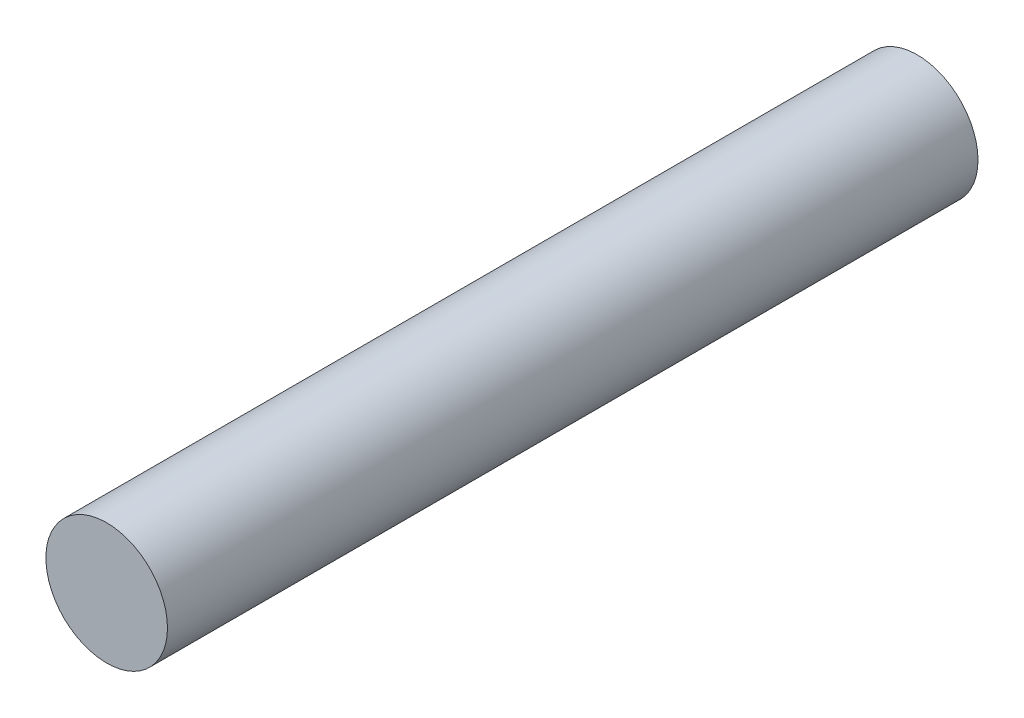
ISO-10303-21;
HEADER;
FILE_DESCRIPTION(('STEP AP214'),'2;1');
FILE_NAME('part.step','',(''),(''),'','','');
FILE_SCHEMA(('AUTOMOTIVE_DESIGN { 1 0 10303 214 1 1 1 1 }'));
ENDSEC;
DATA;
#1=APPLICATION_CONTEXT('core data for automotive mechanical design processes');
#2=APPLICATION_PROTOCOL_DEFINITION('international standard','automotive_design',2000,#1);
#3=PRODUCT_CONTEXT('',#1,'mechanical');
#4=PRODUCT('Part','Part','',(#3));
#5=PRODUCT_RELATED_PRODUCT_CATEGORY('part','',(#4));
#6=PRODUCT_DEFINITION_FORMATION('','',#4);
#7=PRODUCT_DEFINITION_CONTEXT('part definition',#1,'design');
#8=PRODUCT_DEFINITION('design','',#6,#7);
#9=PRODUCT_DEFINITION_SHAPE('','',#8);
#10=(LENGTH_UNIT() NAMED_UNIT(*) SI_UNIT(.MILLI.,.METRE.));
#11=(NAMED_UNIT(*) PLANE_ANGLE_UNIT() SI_UNIT($,.RADIAN.));
#12=(NAMED_UNIT(*) SI_UNIT($,.STERADIAN.) SOLID_ANGLE_UNIT());
#13=UNCERTAINTY_MEASURE_WITH_UNIT(LENGTH_MEASURE(1.E-05),#10,'distance_accuracy_value','');
#14=(GEOMETRIC_REPRESENTATION_CONTEXT(3) GLOBAL_UNCERTAINTY_ASSIGNED_CONTEXT((#13)) GLOBAL_UNIT_ASSIGNED_CONTEXT((#10,
#11,#12)) REPRESENTATION_CONTEXT('',''));
#15=CARTESIAN_POINT('',(0.,0.,0.));
#16=DIRECTION('',(0.,0.,1.));
#17=DIRECTION('',(1.,0.,0.));
#18=AXIS2_PLACEMENT_3D('',#15,#16,#17);
#19=CARTESIAN_POINT('',(0.,0.,20.));
#20=DIRECTION('',(0.,0.,-1.));
#21=DIRECTION('',(-1.,0.,0.));
#22=AXIS2_PLACEMENT_3D('',#19,#20,#21);
#23=CYLINDRICAL_SURFACE('',#22,1.5);
#24=CARTESIAN_POINT('',(0.,0.,20.));
#25=DIRECTION('',(0.,0.,1.));
#26=DIRECTION('',(1.,0.,0.));
#27=AXIS2_PLACEMENT_3D('',#24,#25,#26);
#28=CIRCLE('',#27,1.5);
#29=CARTESIAN_POINT('',(1.5,0.,20.));
#30=VERTEX_POINT('',#29);
#31=EDGE_CURVE('E10',#30,#30,#28,.T.);
#32=ORIENTED_EDGE('',*,*,#31,.F.);
#33=EDGE_LOOP('',(#32));
#34=FACE_BOUND('',#33,.T.);
#35=CARTESIAN_POINT('',(0.,0.,0.));
#36=DIRECTION('',(0.,0.,1.));
#37=DIRECTION('',(1.,0.,0.));
#38=AXIS2_PLACEMENT_3D('',#35,#36,#37);
#39=CIRCLE('',#38,1.5);
#40=CARTESIAN_POINT('',(1.5,0.,0.));
#41=VERTEX_POINT('',#40);
#42=EDGE_CURVE('E33',#41,#41,#39,.T.);
#43=ORIENTED_EDGE('',*,*,#42,.T.);
#44=EDGE_LOOP('',(#43));
#45=FACE_BOUND('',#44,.T.);
#46=ADVANCED_FACE('F30',(#34,#45),#23,.T.);
#47=CARTESIAN_POINT('',(0.,0.,20.));
#48=DIRECTION('',(0.,0.,1.));
#49=DIRECTION('',(1.,0.,0.));
#50=AXIS2_PLACEMENT_3D('',#47,#48,#49);
#51=PLANE('',#50);
#52=ORIENTED_EDGE('',*,*,#31,.T.);
#53=EDGE_LOOP('',(#52));
#54=FACE_BOUND('',#53,.T.);
#55=ADVANCED_FACE('F45',(#54),#51,.T.);
#56=CARTESIAN_POINT('',(0.,0.,0.));
#57=DIRECTION('',(0.,0.,1.));
#58=DIRECTION('',(1.,0.,0.));
#59=AXIS2_PLACEMENT_3D('',#56,#57,#58);
#60=PLANE('',#59);
#61=ORIENTED_EDGE('',*,*,#42,.F.);
#62=EDGE_LOOP('',(#61));
#63=FACE_BOUND('',#62,.T.);
#64=ADVANCED_FACE('F43',(#63),#60,.F.);
#65=CLOSED_SHELL('',(#46,#55,#64));
#66=MANIFOLD_SOLID_BREP('B2',#65);
#67=ADVANCED_BREP_SHAPE_REPRESENTATION('',(#18,#66),#14);
#68=SHAPE_DEFINITION_REPRESENTATION(#9,#67);
ENDSEC;
END-ISO-10303-21;
